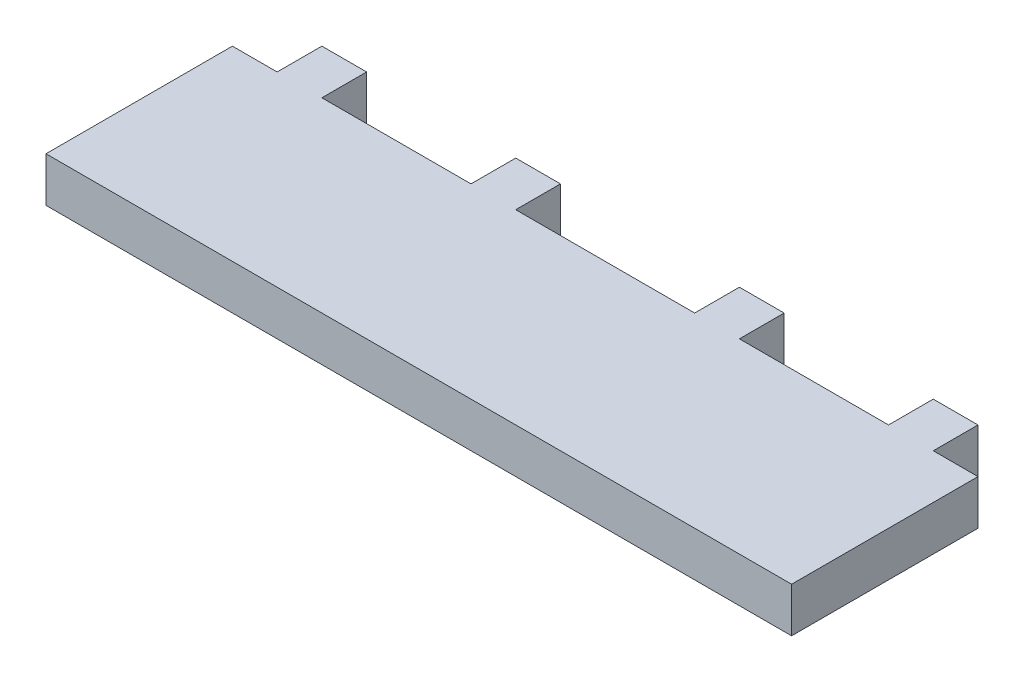
ISO-10303-21;
HEADER;
FILE_DESCRIPTION(('STEP AP214'),'2;1');
FILE_NAME('part.step','',(''),(''),'','','');
FILE_SCHEMA(('AUTOMOTIVE_DESIGN { 1 0 10303 214 1 1 1 1 }'));
ENDSEC;
DATA;
#1=APPLICATION_CONTEXT('core data for automotive mechanical design processes');
#2=APPLICATION_PROTOCOL_DEFINITION('international standard','automotive_design',2000,#1);
#3=PRODUCT_CONTEXT('',#1,'mechanical');
#4=PRODUCT('Part','Part','',(#3));
#5=PRODUCT_RELATED_PRODUCT_CATEGORY('part','',(#4));
#6=PRODUCT_DEFINITION_FORMATION('','',#4);
#7=PRODUCT_DEFINITION_CONTEXT('part definition',#1,'design');
#8=PRODUCT_DEFINITION('design','',#6,#7);
#9=PRODUCT_DEFINITION_SHAPE('','',#8);
#10=(LENGTH_UNIT() NAMED_UNIT(*) SI_UNIT(.MILLI.,.METRE.));
#11=(NAMED_UNIT(*) PLANE_ANGLE_UNIT() SI_UNIT($,.RADIAN.));
#12=(NAMED_UNIT(*) SI_UNIT($,.STERADIAN.) SOLID_ANGLE_UNIT());
#13=UNCERTAINTY_MEASURE_WITH_UNIT(LENGTH_MEASURE(1.E-05),#10,'distance_accuracy_value','');
#14=(GEOMETRIC_REPRESENTATION_CONTEXT(3) GLOBAL_UNCERTAINTY_ASSIGNED_CONTEXT((#13)) GLOBAL_UNIT_ASSIGNED_CONTEXT((#10,
#11,#12)) REPRESENTATION_CONTEXT('',''));
#15=CARTESIAN_POINT('',(0.,0.,0.));
#16=DIRECTION('',(0.,0.,1.));
#17=DIRECTION('',(1.,0.,0.));
#18=AXIS2_PLACEMENT_3D('',#15,#16,#17);
#19=CARTESIAN_POINT('',(0.,0.,0.));
#20=DIRECTION('',(0.,0.,-1.));
#21=DIRECTION('',(-1.,0.,0.));
#22=AXIS2_PLACEMENT_3D('',#19,#20,#21);
#23=PLANE('',#22);
#24=DIRECTION('',(1.,0.,0.));
#25=VECTOR('',#24,1.);
#26=CARTESIAN_POINT('',(50.,0.,0.));
#27=LINE('',#26,#25);
#28=CARTESIAN_POINT('',(-38.,0.,0.));
#29=VERTEX_POINT('',#28);
#30=CARTESIAN_POINT('',(-18.,0.,0.));
#31=VERTEX_POINT('',#30);
#32=EDGE_CURVE('E295',#29,#31,#27,.T.);
#33=ORIENTED_EDGE('',*,*,#32,.F.);
#34=DIRECTION('',(0.,-1.,0.));
#35=VECTOR('',#34,1.);
#36=CARTESIAN_POINT('',(-38.,0.,0.));
#37=LINE('',#36,#35);
#38=CARTESIAN_POINT('',(-38.,6.,0.));
#39=VERTEX_POINT('',#38);
#40=EDGE_CURVE('E51',#39,#29,#37,.T.);
#41=ORIENTED_EDGE('',*,*,#40,.F.);
#42=DIRECTION('',(-1.,0.,0.));
#43=VECTOR('',#42,1.);
#44=CARTESIAN_POINT('',(-50.,5.99999999999999,0.));
#45=LINE('',#44,#43);
#46=CARTESIAN_POINT('',(-18.,6.,0.));
#47=VERTEX_POINT('',#46);
#48=EDGE_CURVE('E347',#47,#39,#45,.T.);
#49=ORIENTED_EDGE('',*,*,#48,.F.);
#50=DIRECTION('',(0.,1.,0.));
#51=VECTOR('',#50,1.);
#52=CARTESIAN_POINT('',(-18.,6.,0.));
#53=LINE('',#52,#51);
#54=EDGE_CURVE('E195',#31,#47,#53,.T.);
#55=ORIENTED_EDGE('',*,*,#54,.F.);
#56=EDGE_LOOP('',(#33,#41,#49,#55));
#57=FACE_BOUND('',#56,.T.);
#58=ADVANCED_FACE('F36',(#57),#23,.T.);
#59=CARTESIAN_POINT('',(-44.,6.,0.));
#60=VERTEX_POINT('',#59);
#61=CARTESIAN_POINT('',(-50.,5.99999999999999,0.));
#62=VERTEX_POINT('',#61);
#63=EDGE_CURVE('E286',#60,#62,#45,.T.);
#64=ORIENTED_EDGE('',*,*,#63,.F.);
#65=DIRECTION('',(0.,1.,0.));
#66=VECTOR('',#65,1.);
#67=CARTESIAN_POINT('',(-44.,6.,0.));
#68=LINE('',#67,#66);
#69=CARTESIAN_POINT('',(-44.,0.,0.));
#70=VERTEX_POINT('',#69);
#71=EDGE_CURVE('E191',#70,#60,#68,.T.);
#72=ORIENTED_EDGE('',*,*,#71,.F.);
#73=CARTESIAN_POINT('',(-50.,0.,0.));
#74=VERTEX_POINT('',#73);
#75=EDGE_CURVE('E277',#74,#70,#27,.T.);
#76=ORIENTED_EDGE('',*,*,#75,.F.);
#77=DIRECTION('',(0.,-1.,0.));
#78=VECTOR('',#77,1.);
#79=CARTESIAN_POINT('',(-50.,0.,0.));
#80=LINE('',#79,#78);
#81=EDGE_CURVE('E290',#62,#74,#80,.T.);
#82=ORIENTED_EDGE('',*,*,#81,.F.);
#83=EDGE_LOOP('',(#64,#72,#76,#82));
#84=FACE_BOUND('',#83,.T.);
#85=ADVANCED_FACE('F311',(#84),#23,.T.);
#86=CARTESIAN_POINT('',(-12.,0.,0.));
#87=VERTEX_POINT('',#86);
#88=CARTESIAN_POINT('',(12.,0.,0.));
#89=VERTEX_POINT('',#88);
#90=EDGE_CURVE('E396',#87,#89,#27,.T.);
#91=ORIENTED_EDGE('',*,*,#90,.F.);
#92=DIRECTION('',(0.,-1.,0.));
#93=VECTOR('',#92,1.);
#94=CARTESIAN_POINT('',(-12.,0.,0.));
#95=LINE('',#94,#93);
#96=CARTESIAN_POINT('',(-12.,6.,0.));
#97=VERTEX_POINT('',#96);
#98=EDGE_CURVE('E59',#97,#87,#95,.T.);
#99=ORIENTED_EDGE('',*,*,#98,.F.);
#100=CARTESIAN_POINT('',(12.,6.,0.));
#101=VERTEX_POINT('',#100);
#102=EDGE_CURVE('E345',#101,#97,#45,.T.);
#103=ORIENTED_EDGE('',*,*,#102,.F.);
#104=DIRECTION('',(0.,1.,0.));
#105=VECTOR('',#104,1.);
#106=CARTESIAN_POINT('',(12.,0.,0.));
#107=LINE('',#106,#105);
#108=EDGE_CURVE('E226',#89,#101,#107,.T.);
#109=ORIENTED_EDGE('',*,*,#108,.F.);
#110=EDGE_LOOP('',(#91,#99,#103,#109));
#111=FACE_BOUND('',#110,.T.);
#112=ADVANCED_FACE('F377',(#111),#23,.T.);
#113=CARTESIAN_POINT('',(18.,0.,0.));
#114=VERTEX_POINT('',#113);
#115=CARTESIAN_POINT('',(38.,0.,0.));
#116=VERTEX_POINT('',#115);
#117=EDGE_CURVE('E344',#114,#116,#27,.T.);
#118=ORIENTED_EDGE('',*,*,#117,.F.);
#119=DIRECTION('',(0.,-1.,0.));
#120=VECTOR('',#119,1.);
#121=CARTESIAN_POINT('',(18.,6.,0.));
#122=LINE('',#121,#120);
#123=CARTESIAN_POINT('',(18.,6.,0.));
#124=VERTEX_POINT('',#123);
#125=EDGE_CURVE('E221',#124,#114,#122,.T.);
#126=ORIENTED_EDGE('',*,*,#125,.F.);
#127=CARTESIAN_POINT('',(38.,5.99999999999999,0.));
#128=VERTEX_POINT('',#127);
#129=EDGE_CURVE('E291',#128,#124,#45,.T.);
#130=ORIENTED_EDGE('',*,*,#129,.F.);
#131=DIRECTION('',(0.,1.,0.));
#132=VECTOR('',#131,1.);
#133=CARTESIAN_POINT('',(38.,0.,0.));
#134=LINE('',#133,#132);
#135=EDGE_CURVE('E250',#116,#128,#134,.T.);
#136=ORIENTED_EDGE('',*,*,#135,.F.);
#137=EDGE_LOOP('',(#118,#126,#130,#136));
#138=FACE_BOUND('',#137,.T.);
#139=ADVANCED_FACE('F342',(#138),#23,.T.);
#140=CARTESIAN_POINT('',(50.,0.,25.));
#141=DIRECTION('',(-1.,0.,0.));
#142=DIRECTION('',(0.,0.,1.));
#143=AXIS2_PLACEMENT_3D('',#140,#141,#142);
#144=PLANE('',#143);
#145=DIRECTION('',(0.,1.,0.));
#146=VECTOR('',#145,1.);
#147=CARTESIAN_POINT('',(50.,0.,0.));
#148=LINE('',#147,#146);
#149=CARTESIAN_POINT('',(50.,0.,0.));
#150=VERTEX_POINT('',#149);
#151=CARTESIAN_POINT('',(50.,5.99999999999999,0.));
#152=VERTEX_POINT('',#151);
#153=EDGE_CURVE('E272',#150,#152,#148,.T.);
#154=ORIENTED_EDGE('',*,*,#153,.T.);
#155=DIRECTION('',(0.,0.,-1.));
#156=VECTOR('',#155,1.);
#157=CARTESIAN_POINT('',(50.,5.99999999999999,25.));
#158=LINE('',#157,#156);
#159=CARTESIAN_POINT('',(50.,5.99999999999999,25.));
#160=VERTEX_POINT('',#159);
#161=EDGE_CURVE('E11',#160,#152,#158,.T.);
#162=ORIENTED_EDGE('',*,*,#161,.F.);
#163=DIRECTION('',(0.,1.,0.));
#164=VECTOR('',#163,1.);
#165=CARTESIAN_POINT('',(50.,0.,25.));
#166=LINE('',#165,#164);
#167=CARTESIAN_POINT('',(50.,0.,25.));
#168=VERTEX_POINT('',#167);
#169=EDGE_CURVE('E273',#168,#160,#166,.T.);
#170=ORIENTED_EDGE('',*,*,#169,.F.);
#171=DIRECTION('',(0.,0.,-1.));
#172=VECTOR('',#171,1.);
#173=CARTESIAN_POINT('',(50.,0.,25.));
#174=LINE('',#173,#172);
#175=EDGE_CURVE('E283',#168,#150,#174,.T.);
#176=ORIENTED_EDGE('',*,*,#175,.T.);
#177=EDGE_LOOP('',(#154,#162,#170,#176));
#178=FACE_BOUND('',#177,.T.);
#179=ADVANCED_FACE('F38',(#178),#144,.F.);
#180=CARTESIAN_POINT('',(-50.,5.99999999999999,25.));
#181=DIRECTION('',(0.,-1.,0.));
#182=DIRECTION('',(0.,0.,-1.));
#183=AXIS2_PLACEMENT_3D('',#180,#181,#182);
#184=PLANE('',#183);
#185=CARTESIAN_POINT('',(44.,5.99999999999999,0.));
#186=VERTEX_POINT('',#185);
#187=EDGE_CURVE('E287',#152,#186,#45,.T.);
#188=ORIENTED_EDGE('',*,*,#187,.T.);
#189=DIRECTION('',(0.,0.,1.));
#190=VECTOR('',#189,1.);
#191=CARTESIAN_POINT('',(44.,6.,-6.));
#192=LINE('',#191,#190);
#193=CARTESIAN_POINT('',(44.,6.,-6.));
#194=VERTEX_POINT('',#193);
#195=EDGE_CURVE('E269',#194,#186,#192,.T.);
#196=ORIENTED_EDGE('',*,*,#195,.F.);
#197=DIRECTION('',(1.,0.,0.));
#198=VECTOR('',#197,1.);
#199=CARTESIAN_POINT('',(38.,6.,-6.));
#200=LINE('',#199,#198);
#201=CARTESIAN_POINT('',(38.,6.,-6.));
#202=VERTEX_POINT('',#201);
#203=EDGE_CURVE('E246',#202,#194,#200,.T.);
#204=ORIENTED_EDGE('',*,*,#203,.F.);
#205=DIRECTION('',(0.,0.,1.));
#206=VECTOR('',#205,1.);
#207=CARTESIAN_POINT('',(38.,6.,-6.));
#208=LINE('',#207,#206);
#209=EDGE_CURVE('E256',#202,#128,#208,.T.);
#210=ORIENTED_EDGE('',*,*,#209,.T.);
#211=ORIENTED_EDGE('',*,*,#129,.T.);
#212=DIRECTION('',(0.,0.,1.));
#213=VECTOR('',#212,1.);
#214=CARTESIAN_POINT('',(18.,6.,-6.));
#215=LINE('',#214,#213);
#216=CARTESIAN_POINT('',(18.,6.,-6.));
#217=VERTEX_POINT('',#216);
#218=EDGE_CURVE('E243',#217,#124,#215,.T.);
#219=ORIENTED_EDGE('',*,*,#218,.F.);
#220=DIRECTION('',(1.,0.,0.));
#221=VECTOR('',#220,1.);
#222=CARTESIAN_POINT('',(12.,6.,-6.));
#223=LINE('',#222,#221);
#224=CARTESIAN_POINT('',(12.,6.,-6.));
#225=VERTEX_POINT('',#224);
#226=EDGE_CURVE('E222',#225,#217,#223,.T.);
#227=ORIENTED_EDGE('',*,*,#226,.F.);
#228=DIRECTION('',(0.,0.,1.));
#229=VECTOR('',#228,1.);
#230=CARTESIAN_POINT('',(12.,6.,-6.));
#231=LINE('',#230,#229);
#232=EDGE_CURVE('E232',#225,#101,#231,.T.);
#233=ORIENTED_EDGE('',*,*,#232,.T.);
#234=ORIENTED_EDGE('',*,*,#102,.T.);
#235=DIRECTION('',(0.,0.,1.));
#236=VECTOR('',#235,1.);
#237=CARTESIAN_POINT('',(-12.,6.,-6.));
#238=LINE('',#237,#236);
#239=CARTESIAN_POINT('',(-12.,6.,-6.));
#240=VERTEX_POINT('',#239);
#241=EDGE_CURVE('E209',#240,#97,#238,.T.);
#242=ORIENTED_EDGE('',*,*,#241,.F.);
#243=DIRECTION('',(1.,0.,0.));
#244=VECTOR('',#243,1.);
#245=CARTESIAN_POINT('',(-12.,6.,-6.));
#246=LINE('',#245,#244);
#247=CARTESIAN_POINT('',(-18.,6.,-6.));
#248=VERTEX_POINT('',#247);
#249=EDGE_CURVE('E208',#248,#240,#246,.T.);
#250=ORIENTED_EDGE('',*,*,#249,.F.);
#251=DIRECTION('',(0.,0.,1.));
#252=VECTOR('',#251,1.);
#253=CARTESIAN_POINT('',(-18.,6.,-6.));
#254=LINE('',#253,#252);
#255=EDGE_CURVE('E213',#248,#47,#254,.T.);
#256=ORIENTED_EDGE('',*,*,#255,.T.);
#257=ORIENTED_EDGE('',*,*,#48,.T.);
#258=DIRECTION('',(0.,0.,1.));
#259=VECTOR('',#258,1.);
#260=CARTESIAN_POINT('',(-38.,6.,-6.));
#261=LINE('',#260,#259);
#262=CARTESIAN_POINT('',(-38.,6.,-6.));
#263=VERTEX_POINT('',#262);
#264=EDGE_CURVE('E355',#263,#39,#261,.T.);
#265=ORIENTED_EDGE('',*,*,#264,.F.);
#266=DIRECTION('',(1.,0.,0.));
#267=VECTOR('',#266,1.);
#268=CARTESIAN_POINT('',(-38.,6.,-6.));
#269=LINE('',#268,#267);
#270=CARTESIAN_POINT('',(-44.,6.,-6.));
#271=VERTEX_POINT('',#270);
#272=EDGE_CURVE('E189',#271,#263,#269,.T.);
#273=ORIENTED_EDGE('',*,*,#272,.F.);
#274=DIRECTION('',(0.,0.,1.));
#275=VECTOR('',#274,1.);
#276=CARTESIAN_POINT('',(-44.,6.,-6.));
#277=LINE('',#276,#275);
#278=EDGE_CURVE('E197',#271,#60,#277,.T.);
#279=ORIENTED_EDGE('',*,*,#278,.T.);
#280=ORIENTED_EDGE('',*,*,#63,.T.);
#281=DIRECTION('',(0.,0.,-1.));
#282=VECTOR('',#281,1.);
#283=CARTESIAN_POINT('',(-50.,5.99999999999999,25.));
#284=LINE('',#283,#282);
#285=CARTESIAN_POINT('',(-50.,5.99999999999999,25.));
#286=VERTEX_POINT('',#285);
#287=EDGE_CURVE('E44',#286,#62,#284,.T.);
#288=ORIENTED_EDGE('',*,*,#287,.F.);
#289=DIRECTION('',(-1.,0.,0.));
#290=VECTOR('',#289,1.);
#291=CARTESIAN_POINT('',(-50.,5.99999999999999,25.));
#292=LINE('',#291,#290);
#293=EDGE_CURVE('E276',#160,#286,#292,.T.);
#294=ORIENTED_EDGE('',*,*,#293,.F.);
#295=ORIENTED_EDGE('',*,*,#161,.T.);
#296=EDGE_LOOP('',(#188,#196,#204,#210,#211,#219,#227,#233,#234,#242,#250,#256,#257,#265,#273,
#279,#280,#288,#294,#295));
#297=FACE_BOUND('',#296,.T.);
#298=ADVANCED_FACE('F319',(#297),#184,.F.);
#299=CARTESIAN_POINT('',(-50.,0.,25.));
#300=DIRECTION('',(1.,0.,0.));
#301=DIRECTION('',(0.,0.,-1.));
#302=AXIS2_PLACEMENT_3D('',#299,#300,#301);
#303=PLANE('',#302);
#304=ORIENTED_EDGE('',*,*,#81,.T.);
#305=DIRECTION('',(0.,0.,-1.));
#306=VECTOR('',#305,1.);
#307=CARTESIAN_POINT('',(-50.,0.,25.));
#308=LINE('',#307,#306);
#309=CARTESIAN_POINT('',(-50.,0.,25.));
#310=VERTEX_POINT('',#309);
#311=EDGE_CURVE('E298',#310,#74,#308,.T.);
#312=ORIENTED_EDGE('',*,*,#311,.F.);
#313=DIRECTION('',(0.,-1.,0.));
#314=VECTOR('',#313,1.);
#315=CARTESIAN_POINT('',(-50.,0.,25.));
#316=LINE('',#315,#314);
#317=EDGE_CURVE('E279',#286,#310,#316,.T.);
#318=ORIENTED_EDGE('',*,*,#317,.F.);
#319=ORIENTED_EDGE('',*,*,#287,.T.);
#320=EDGE_LOOP('',(#304,#312,#318,#319));
#321=FACE_BOUND('',#320,.T.);
#322=ADVANCED_FACE('F305',(#321),#303,.F.);
#323=CARTESIAN_POINT('',(50.,0.,25.));
#324=DIRECTION('',(0.,1.,0.));
#325=DIRECTION('',(0.,0.,1.));
#326=AXIS2_PLACEMENT_3D('',#323,#324,#325);
#327=PLANE('',#326);
#328=ORIENTED_EDGE('',*,*,#75,.T.);
#329=DIRECTION('',(0.,0.,1.));
#330=VECTOR('',#329,1.);
#331=CARTESIAN_POINT('',(-44.,0.,-6.));
#332=LINE('',#331,#330);
#333=CARTESIAN_POINT('',(-44.,0.,-6.));
#334=VERTEX_POINT('',#333);
#335=EDGE_CURVE('E180',#334,#70,#332,.T.);
#336=ORIENTED_EDGE('',*,*,#335,.F.);
#337=DIRECTION('',(-1.,0.,0.));
#338=VECTOR('',#337,1.);
#339=CARTESIAN_POINT('',(-44.,0.,-6.));
#340=LINE('',#339,#338);
#341=CARTESIAN_POINT('',(-38.,0.,-6.));
#342=VERTEX_POINT('',#341);
#343=EDGE_CURVE('E174',#342,#334,#340,.T.);
#344=ORIENTED_EDGE('',*,*,#343,.F.);
#345=DIRECTION('',(0.,0.,1.));
#346=VECTOR('',#345,1.);
#347=CARTESIAN_POINT('',(-38.,0.,-6.));
#348=LINE('',#347,#346);
#349=EDGE_CURVE('E178',#342,#29,#348,.T.);
#350=ORIENTED_EDGE('',*,*,#349,.T.);
#351=ORIENTED_EDGE('',*,*,#32,.T.);
#352=DIRECTION('',(0.,0.,1.));
#353=VECTOR('',#352,1.);
#354=CARTESIAN_POINT('',(-18.,0.,-6.));
#355=LINE('',#354,#353);
#356=CARTESIAN_POINT('',(-18.,0.,-6.));
#357=VERTEX_POINT('',#356);
#358=EDGE_CURVE('E216',#357,#31,#355,.T.);
#359=ORIENTED_EDGE('',*,*,#358,.F.);
#360=DIRECTION('',(-1.,0.,0.));
#361=VECTOR('',#360,1.);
#362=CARTESIAN_POINT('',(-18.,0.,-6.));
#363=LINE('',#362,#361);
#364=CARTESIAN_POINT('',(-12.,0.,-6.));
#365=VERTEX_POINT('',#364);
#366=EDGE_CURVE('E204',#365,#357,#363,.T.);
#367=ORIENTED_EDGE('',*,*,#366,.F.);
#368=DIRECTION('',(0.,0.,1.));
#369=VECTOR('',#368,1.);
#370=CARTESIAN_POINT('',(-12.,0.,-6.));
#371=LINE('',#370,#369);
#372=EDGE_CURVE('E219',#365,#87,#371,.T.);
#373=ORIENTED_EDGE('',*,*,#372,.T.);
#374=ORIENTED_EDGE('',*,*,#90,.T.);
#375=DIRECTION('',(0.,0.,1.));
#376=VECTOR('',#375,1.);
#377=CARTESIAN_POINT('',(12.,0.,-6.));
#378=LINE('',#377,#376);
#379=CARTESIAN_POINT('',(12.,0.,-6.));
#380=VERTEX_POINT('',#379);
#381=EDGE_CURVE('E238',#380,#89,#378,.T.);
#382=ORIENTED_EDGE('',*,*,#381,.F.);
#383=DIRECTION('',(-1.,0.,0.));
#384=VECTOR('',#383,1.);
#385=CARTESIAN_POINT('',(18.,0.,-6.));
#386=LINE('',#385,#384);
#387=CARTESIAN_POINT('',(18.,0.,-6.));
#388=VERTEX_POINT('',#387);
#389=EDGE_CURVE('E228',#388,#380,#386,.T.);
#390=ORIENTED_EDGE('',*,*,#389,.F.);
#391=DIRECTION('',(0.,0.,1.));
#392=VECTOR('',#391,1.);
#393=CARTESIAN_POINT('',(18.,0.,-6.));
#394=LINE('',#393,#392);
#395=EDGE_CURVE('E241',#388,#114,#394,.T.);
#396=ORIENTED_EDGE('',*,*,#395,.T.);
#397=ORIENTED_EDGE('',*,*,#117,.T.);
#398=DIRECTION('',(0.,0.,1.));
#399=VECTOR('',#398,1.);
#400=CARTESIAN_POINT('',(38.,0.,-6.));
#401=LINE('',#400,#399);
#402=CARTESIAN_POINT('',(38.,0.,-6.));
#403=VERTEX_POINT('',#402);
#404=EDGE_CURVE('E263',#403,#116,#401,.T.);
#405=ORIENTED_EDGE('',*,*,#404,.F.);
#406=DIRECTION('',(-1.,0.,0.));
#407=VECTOR('',#406,1.);
#408=CARTESIAN_POINT('',(44.,0.,-6.));
#409=LINE('',#408,#407);
#410=CARTESIAN_POINT('',(44.,0.,-6.));
#411=VERTEX_POINT('',#410);
#412=EDGE_CURVE('E252',#411,#403,#409,.T.);
#413=ORIENTED_EDGE('',*,*,#412,.F.);
#414=DIRECTION('',(0.,0.,1.));
#415=VECTOR('',#414,1.);
#416=CARTESIAN_POINT('',(44.,0.,-6.));
#417=LINE('',#416,#415);
#418=CARTESIAN_POINT('',(44.,0.,0.));
#419=VERTEX_POINT('',#418);
#420=EDGE_CURVE('E266',#411,#419,#417,.T.);
#421=ORIENTED_EDGE('',*,*,#420,.T.);
#422=EDGE_CURVE('E293',#419,#150,#27,.T.);
#423=ORIENTED_EDGE('',*,*,#422,.T.);
#424=ORIENTED_EDGE('',*,*,#175,.F.);
#425=DIRECTION('',(1.,0.,0.));
#426=VECTOR('',#425,1.);
#427=CARTESIAN_POINT('',(50.,0.,25.));
#428=LINE('',#427,#426);
#429=EDGE_CURVE('E281',#310,#168,#428,.T.);
#430=ORIENTED_EDGE('',*,*,#429,.F.);
#431=ORIENTED_EDGE('',*,*,#311,.T.);
#432=EDGE_LOOP('',(#328,#336,#344,#350,#351,#359,#367,#373,#374,#382,#390,#396,#397,#405,#413,
#421,#423,#424,#430,#431));
#433=FACE_BOUND('',#432,.T.);
#434=ADVANCED_FACE('F177',(#433),#327,.F.);
#435=CARTESIAN_POINT('',(0.,0.,25.));
#436=DIRECTION('',(0.,0.,-1.));
#437=DIRECTION('',(-1.,0.,0.));
#438=AXIS2_PLACEMENT_3D('',#435,#436,#437);
#439=PLANE('',#438);
#440=ORIENTED_EDGE('',*,*,#169,.T.);
#441=ORIENTED_EDGE('',*,*,#293,.T.);
#442=ORIENTED_EDGE('',*,*,#317,.T.);
#443=ORIENTED_EDGE('',*,*,#429,.T.);
#444=EDGE_LOOP('',(#440,#441,#442,#443));
#445=FACE_BOUND('',#444,.T.);
#446=ADVANCED_FACE('F317',(#445),#439,.F.);
#447=DIRECTION('',(0.,-1.,0.));
#448=VECTOR('',#447,1.);
#449=CARTESIAN_POINT('',(44.,6.,0.));
#450=LINE('',#449,#448);
#451=EDGE_CURVE('E245',#186,#419,#450,.T.);
#452=ORIENTED_EDGE('',*,*,#451,.F.);
#453=ORIENTED_EDGE('',*,*,#187,.F.);
#454=ORIENTED_EDGE('',*,*,#153,.F.);
#455=ORIENTED_EDGE('',*,*,#422,.F.);
#456=EDGE_LOOP('',(#452,#453,#454,#455));
#457=FACE_BOUND('',#456,.T.);
#458=ADVANCED_FACE('F324',(#457),#23,.T.);
#459=CARTESIAN_POINT('',(44.,6.,-6.));
#460=DIRECTION('',(-1.,0.,0.));
#461=DIRECTION('',(0.,0.,1.));
#462=AXIS2_PLACEMENT_3D('',#459,#460,#461);
#463=PLANE('',#462);
#464=ORIENTED_EDGE('',*,*,#451,.T.);
#465=ORIENTED_EDGE('',*,*,#420,.F.);
#466=DIRECTION('',(0.,-1.,0.));
#467=VECTOR('',#466,1.);
#468=CARTESIAN_POINT('',(44.,6.,-6.));
#469=LINE('',#468,#467);
#470=EDGE_CURVE('E249',#194,#411,#469,.T.);
#471=ORIENTED_EDGE('',*,*,#470,.F.);
#472=ORIENTED_EDGE('',*,*,#195,.T.);
#473=EDGE_LOOP('',(#464,#465,#471,#472));
#474=FACE_BOUND('',#473,.T.);
#475=ADVANCED_FACE('F327',(#474),#463,.F.);
#476=CARTESIAN_POINT('',(38.,0.,-6.));
#477=DIRECTION('',(1.,0.,0.));
#478=DIRECTION('',(0.,0.,-1.));
#479=AXIS2_PLACEMENT_3D('',#476,#477,#478);
#480=PLANE('',#479);
#481=ORIENTED_EDGE('',*,*,#135,.T.);
#482=ORIENTED_EDGE('',*,*,#209,.F.);
#483=DIRECTION('',(0.,1.,0.));
#484=VECTOR('',#483,1.);
#485=CARTESIAN_POINT('',(38.,0.,-6.));
#486=LINE('',#485,#484);
#487=EDGE_CURVE('E254',#403,#202,#486,.T.);
#488=ORIENTED_EDGE('',*,*,#487,.F.);
#489=ORIENTED_EDGE('',*,*,#404,.T.);
#490=EDGE_LOOP('',(#481,#482,#488,#489));
#491=FACE_BOUND('',#490,.T.);
#492=ADVANCED_FACE('F338',(#491),#480,.F.);
#493=CARTESIAN_POINT('',(0.,0.,-6.));
#494=DIRECTION('',(0.,0.,-1.));
#495=DIRECTION('',(-1.,0.,0.));
#496=AXIS2_PLACEMENT_3D('',#493,#494,#495);
#497=PLANE('',#496);
#498=ORIENTED_EDGE('',*,*,#203,.T.);
#499=ORIENTED_EDGE('',*,*,#470,.T.);
#500=ORIENTED_EDGE('',*,*,#412,.T.);
#501=ORIENTED_EDGE('',*,*,#487,.T.);
#502=EDGE_LOOP('',(#498,#499,#500,#501));
#503=FACE_BOUND('',#502,.T.);
#504=ADVANCED_FACE('F332',(#503),#497,.T.);
#505=CARTESIAN_POINT('',(18.,6.,-6.));
#506=DIRECTION('',(-1.,0.,0.));
#507=DIRECTION('',(0.,-1.,0.));
#508=AXIS2_PLACEMENT_3D('',#505,#506,#507);
#509=PLANE('',#508);
#510=ORIENTED_EDGE('',*,*,#125,.T.);
#511=ORIENTED_EDGE('',*,*,#395,.F.);
#512=DIRECTION('',(0.,-1.,0.));
#513=VECTOR('',#512,1.);
#514=CARTESIAN_POINT('',(18.,6.,-6.));
#515=LINE('',#514,#513);
#516=EDGE_CURVE('E225',#217,#388,#515,.T.);
#517=ORIENTED_EDGE('',*,*,#516,.F.);
#518=ORIENTED_EDGE('',*,*,#218,.T.);
#519=EDGE_LOOP('',(#510,#511,#517,#518));
#520=FACE_BOUND('',#519,.T.);
#521=ADVANCED_FACE('F401',(#520),#509,.F.);
#522=CARTESIAN_POINT('',(12.,0.,-6.));
#523=DIRECTION('',(1.,0.,0.));
#524=DIRECTION('',(0.,0.,-1.));
#525=AXIS2_PLACEMENT_3D('',#522,#523,#524);
#526=PLANE('',#525);
#527=ORIENTED_EDGE('',*,*,#108,.T.);
#528=ORIENTED_EDGE('',*,*,#232,.F.);
#529=DIRECTION('',(0.,1.,0.));
#530=VECTOR('',#529,1.);
#531=CARTESIAN_POINT('',(12.,0.,-6.));
#532=LINE('',#531,#530);
#533=EDGE_CURVE('E230',#380,#225,#532,.T.);
#534=ORIENTED_EDGE('',*,*,#533,.F.);
#535=ORIENTED_EDGE('',*,*,#381,.T.);
#536=EDGE_LOOP('',(#527,#528,#534,#535));
#537=FACE_BOUND('',#536,.T.);
#538=ADVANCED_FACE('F408',(#537),#526,.F.);
#539=CARTESIAN_POINT('',(0.,0.,-6.));
#540=DIRECTION('',(0.,0.,-1.));
#541=DIRECTION('',(-1.,0.,0.));
#542=AXIS2_PLACEMENT_3D('',#539,#540,#541);
#543=PLANE('',#542);
#544=ORIENTED_EDGE('',*,*,#226,.T.);
#545=ORIENTED_EDGE('',*,*,#516,.T.);
#546=ORIENTED_EDGE('',*,*,#389,.T.);
#547=ORIENTED_EDGE('',*,*,#533,.T.);
#548=EDGE_LOOP('',(#544,#545,#546,#547));
#549=FACE_BOUND('',#548,.T.);
#550=ADVANCED_FACE('F405',(#549),#543,.T.);
#551=CARTESIAN_POINT('',(-12.,0.,-6.));
#552=DIRECTION('',(-1.,0.,0.));
#553=DIRECTION('',(0.,0.,1.));
#554=AXIS2_PLACEMENT_3D('',#551,#552,#553);
#555=PLANE('',#554);
#556=ORIENTED_EDGE('',*,*,#98,.T.);
#557=ORIENTED_EDGE('',*,*,#372,.F.);
#558=DIRECTION('',(0.,-1.,0.));
#559=VECTOR('',#558,1.);
#560=CARTESIAN_POINT('',(-12.,0.,-6.));
#561=LINE('',#560,#559);
#562=EDGE_CURVE('E201',#240,#365,#561,.T.);
#563=ORIENTED_EDGE('',*,*,#562,.F.);
#564=ORIENTED_EDGE('',*,*,#241,.T.);
#565=EDGE_LOOP('',(#556,#557,#563,#564));
#566=FACE_BOUND('',#565,.T.);
#567=ADVANCED_FACE('F415',(#566),#555,.F.);
#568=CARTESIAN_POINT('',(-18.,6.,-6.));
#569=DIRECTION('',(1.,0.,0.));
#570=DIRECTION('',(0.,1.,0.));
#571=AXIS2_PLACEMENT_3D('',#568,#569,#570);
#572=PLANE('',#571);
#573=ORIENTED_EDGE('',*,*,#54,.T.);
#574=ORIENTED_EDGE('',*,*,#255,.F.);
#575=DIRECTION('',(0.,1.,0.));
#576=VECTOR('',#575,1.);
#577=CARTESIAN_POINT('',(-18.,6.,-6.));
#578=LINE('',#577,#576);
#579=EDGE_CURVE('E206',#357,#248,#578,.T.);
#580=ORIENTED_EDGE('',*,*,#579,.F.);
#581=ORIENTED_EDGE('',*,*,#358,.T.);
#582=EDGE_LOOP('',(#573,#574,#580,#581));
#583=FACE_BOUND('',#582,.T.);
#584=ADVANCED_FACE('F454',(#583),#572,.F.);
#585=CARTESIAN_POINT('',(0.,0.,-6.));
#586=DIRECTION('',(0.,0.,1.));
#587=DIRECTION('',(1.,0.,0.));
#588=AXIS2_PLACEMENT_3D('',#585,#586,#587);
#589=PLANE('',#588);
#590=ORIENTED_EDGE('',*,*,#562,.T.);
#591=ORIENTED_EDGE('',*,*,#366,.T.);
#592=ORIENTED_EDGE('',*,*,#579,.T.);
#593=ORIENTED_EDGE('',*,*,#249,.T.);
#594=EDGE_LOOP('',(#590,#591,#592,#593));
#595=FACE_BOUND('',#594,.T.);
#596=ADVANCED_FACE('F369',(#595),#589,.F.);
#597=CARTESIAN_POINT('',(-38.,0.,-6.));
#598=DIRECTION('',(-1.,0.,0.));
#599=DIRECTION('',(0.,0.,1.));
#600=AXIS2_PLACEMENT_3D('',#597,#598,#599);
#601=PLANE('',#600);
#602=ORIENTED_EDGE('',*,*,#40,.T.);
#603=ORIENTED_EDGE('',*,*,#349,.F.);
#604=DIRECTION('',(0.,-1.,0.));
#605=VECTOR('',#604,1.);
#606=CARTESIAN_POINT('',(-38.,0.,-6.));
#607=LINE('',#606,#605);
#608=EDGE_CURVE('E184',#263,#342,#607,.T.);
#609=ORIENTED_EDGE('',*,*,#608,.F.);
#610=ORIENTED_EDGE('',*,*,#264,.T.);
#611=EDGE_LOOP('',(#602,#603,#609,#610));
#612=FACE_BOUND('',#611,.T.);
#613=ADVANCED_FACE('F193',(#612),#601,.F.);
#614=CARTESIAN_POINT('',(-44.,6.,-6.));
#615=DIRECTION('',(1.,0.,0.));
#616=DIRECTION('',(0.,0.,-1.));
#617=AXIS2_PLACEMENT_3D('',#614,#615,#616);
#618=PLANE('',#617);
#619=ORIENTED_EDGE('',*,*,#71,.T.);
#620=ORIENTED_EDGE('',*,*,#278,.F.);
#621=DIRECTION('',(0.,1.,0.));
#622=VECTOR('',#621,1.);
#623=CARTESIAN_POINT('',(-44.,6.,-6.));
#624=LINE('',#623,#622);
#625=EDGE_CURVE('E183',#334,#271,#624,.T.);
#626=ORIENTED_EDGE('',*,*,#625,.F.);
#627=ORIENTED_EDGE('',*,*,#335,.T.);
#628=EDGE_LOOP('',(#619,#620,#626,#627));
#629=FACE_BOUND('',#628,.T.);
#630=ADVANCED_FACE('F361',(#629),#618,.F.);
#631=CARTESIAN_POINT('',(0.,0.,-6.));
#632=DIRECTION('',(0.,0.,1.));
#633=DIRECTION('',(1.,0.,0.));
#634=AXIS2_PLACEMENT_3D('',#631,#632,#633);
#635=PLANE('',#634);
#636=ORIENTED_EDGE('',*,*,#608,.T.);
#637=ORIENTED_EDGE('',*,*,#343,.T.);
#638=ORIENTED_EDGE('',*,*,#625,.T.);
#639=ORIENTED_EDGE('',*,*,#272,.T.);
#640=EDGE_LOOP('',(#636,#637,#638,#639));
#641=FACE_BOUND('',#640,.T.);
#642=ADVANCED_FACE('F187',(#641),#635,.F.);
#643=CLOSED_SHELL('',(#58,#85,#112,#139,#179,#298,#322,#434,#446,#458,#475,#492,#504,#521,#538,
#550,#567,#584,#596,#613,#630,#642));
#644=MANIFOLD_SOLID_BREP('B2',#643);
#645=ADVANCED_BREP_SHAPE_REPRESENTATION('',(#18,#644),#14);
#646=SHAPE_DEFINITION_REPRESENTATION(#9,#645);
ENDSEC;
END-ISO-10303-21;
